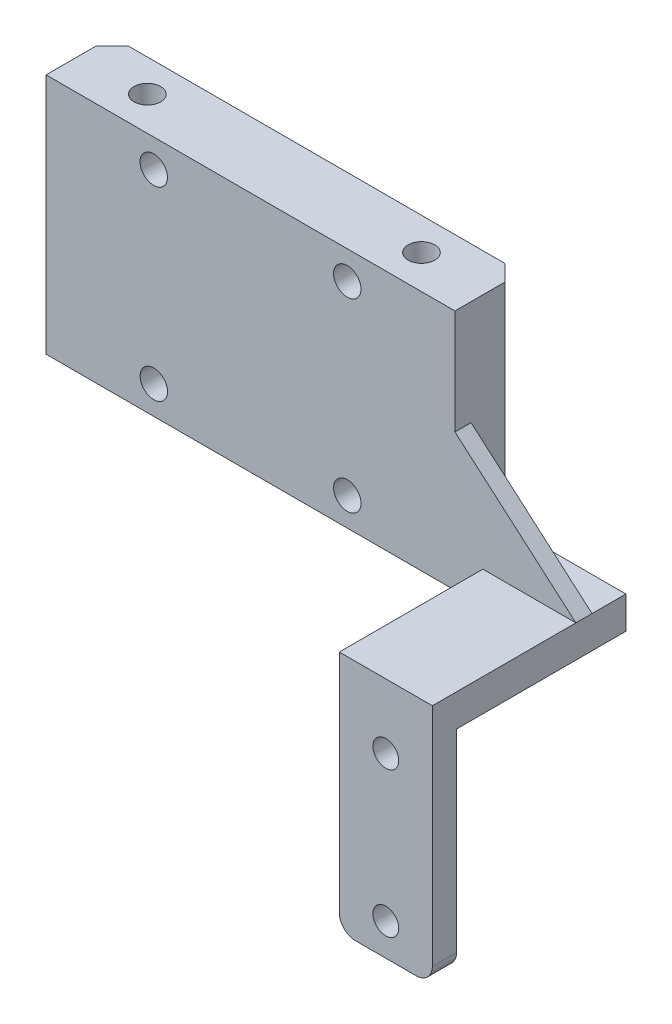
ISO-10303-21;
HEADER;
FILE_DESCRIPTION(('STEP AP214'),'2;1');
FILE_NAME('part.step','',(''),(''),'','','');
FILE_SCHEMA(('AUTOMOTIVE_DESIGN { 1 0 10303 214 1 1 1 1 }'));
ENDSEC;
DATA;
#1=APPLICATION_CONTEXT('core data for automotive mechanical design processes');
#2=APPLICATION_PROTOCOL_DEFINITION('international standard','automotive_design',2000,#1);
#3=PRODUCT_CONTEXT('',#1,'mechanical');
#4=PRODUCT('Part','Part','',(#3));
#5=PRODUCT_RELATED_PRODUCT_CATEGORY('part','',(#4));
#6=PRODUCT_DEFINITION_FORMATION('','',#4);
#7=PRODUCT_DEFINITION_CONTEXT('part definition',#1,'design');
#8=PRODUCT_DEFINITION('design','',#6,#7);
#9=PRODUCT_DEFINITION_SHAPE('','',#8);
#10=(LENGTH_UNIT() NAMED_UNIT(*) SI_UNIT(.MILLI.,.METRE.));
#11=(NAMED_UNIT(*) PLANE_ANGLE_UNIT() SI_UNIT($,.RADIAN.));
#12=(NAMED_UNIT(*) SI_UNIT($,.STERADIAN.) SOLID_ANGLE_UNIT());
#13=UNCERTAINTY_MEASURE_WITH_UNIT(LENGTH_MEASURE(1.E-05),#10,'distance_accuracy_value','');
#14=(GEOMETRIC_REPRESENTATION_CONTEXT(3) GLOBAL_UNCERTAINTY_ASSIGNED_CONTEXT((#13)) GLOBAL_UNIT_ASSIGNED_CONTEXT((#10,
#11,#12)) REPRESENTATION_CONTEXT('',''));
#15=CARTESIAN_POINT('',(0.,0.,0.));
#16=DIRECTION('',(0.,0.,1.));
#17=DIRECTION('',(1.,0.,0.));
#18=AXIS2_PLACEMENT_3D('',#15,#16,#17);
#19=CARTESIAN_POINT('',(26.8547945205479,10.7071917808219,8.2));
#20=DIRECTION('',(-1.,0.,0.));
#21=DIRECTION('',(0.,-1.,0.));
#22=AXIS2_PLACEMENT_3D('',#19,#20,#21);
#23=PLANE('',#22);
#24=DIRECTION('',(0.,0.,1.));
#25=VECTOR('',#24,1.);
#26=CARTESIAN_POINT('',(26.854794520548,-2.29280821917808,6.2));
#27=LINE('',#26,#25);
#28=CARTESIAN_POINT('',(26.854794520548,-2.29280821917808,6.2));
#29=VERTEX_POINT('',#28);
#30=CARTESIAN_POINT('',(26.854794520548,-2.29280821917808,8.2));
#31=VERTEX_POINT('',#30);
#32=EDGE_CURVE('E56',#29,#31,#27,.T.);
#33=ORIENTED_EDGE('',*,*,#32,.F.);
#34=DIRECTION('',(0.,1.,0.));
#35=VECTOR('',#34,1.);
#36=CARTESIAN_POINT('',(26.854794520548,0.,6.2));
#37=LINE('',#36,#35);
#38=CARTESIAN_POINT('',(26.854794520548,-15.2928082191781,6.2));
#39=VERTEX_POINT('',#38);
#40=EDGE_CURVE('E429',#39,#29,#37,.T.);
#41=ORIENTED_EDGE('',*,*,#40,.F.);
#42=DIRECTION('',(0.,0.,1.));
#43=VECTOR('',#42,1.);
#44=CARTESIAN_POINT('',(26.854794520548,-15.2928082191781,2.));
#45=LINE('',#44,#43);
#46=CARTESIAN_POINT('',(26.854794520548,-15.2928082191781,2.));
#47=VERTEX_POINT('',#46);
#48=EDGE_CURVE('E177',#47,#39,#45,.T.);
#49=ORIENTED_EDGE('',*,*,#48,.F.);
#50=DIRECTION('',(0.,1.,0.));
#51=VECTOR('',#50,1.);
#52=CARTESIAN_POINT('',(26.854794520548,-19.2928082191781,2.));
#53=LINE('',#52,#51);
#54=CARTESIAN_POINT('',(26.854794520548,10.7071917808219,2.));
#55=VERTEX_POINT('',#54);
#56=EDGE_CURVE('E330',#47,#55,#53,.T.);
#57=ORIENTED_EDGE('',*,*,#56,.T.);
#58=DIRECTION('',(0.,0.,-1.));
#59=VECTOR('',#58,1.);
#60=CARTESIAN_POINT('',(26.8547945205479,10.7071917808219,8.2));
#61=LINE('',#60,#59);
#62=CARTESIAN_POINT('',(26.8547945205479,10.7071917808219,8.2));
#63=VERTEX_POINT('',#62);
#64=EDGE_CURVE('E348',#63,#55,#61,.T.);
#65=ORIENTED_EDGE('',*,*,#64,.F.);
#66=DIRECTION('',(0.,1.,0.));
#67=VECTOR('',#66,1.);
#68=CARTESIAN_POINT('',(26.8547945205479,10.7071917808219,8.2));
#69=LINE('',#68,#67);
#70=EDGE_CURVE('E61',#31,#63,#69,.T.);
#71=ORIENTED_EDGE('',*,*,#70,.F.);
#72=EDGE_LOOP('',(#33,#41,#49,#57,#65,#71));
#73=FACE_BOUND('',#72,.T.);
#74=ADVANCED_FACE('F41',(#73),#23,.F.);
#75=CARTESIAN_POINT('',(0.,-15.2928082191781,0.));
#76=DIRECTION('',(0.,1.,0.));
#77=DIRECTION('',(0.,0.,1.));
#78=AXIS2_PLACEMENT_3D('',#75,#76,#77);
#79=PLANE('',#78);
#80=ORIENTED_EDGE('',*,*,#48,.T.);
#81=DIRECTION('',(-1.,0.,0.));
#82=VECTOR('',#81,1.);
#83=CARTESIAN_POINT('',(0.,-15.2928082191781,6.2));
#84=LINE('',#83,#82);
#85=CARTESIAN_POINT('',(41.8542610712507,-15.2928082191781,6.2));
#86=VERTEX_POINT('',#85);
#87=EDGE_CURVE('E172',#86,#39,#84,.T.);
#88=ORIENTED_EDGE('',*,*,#87,.F.);
#89=DIRECTION('',(0.,0.,1.));
#90=VECTOR('',#89,1.);
#91=CARTESIAN_POINT('',(41.8542610712507,-15.2928082191781,6.2));
#92=LINE('',#91,#90);
#93=CARTESIAN_POINT('',(41.8542610712507,-15.2928082191781,8.2));
#94=VERTEX_POINT('',#93);
#95=EDGE_CURVE('E165',#86,#94,#92,.T.);
#96=ORIENTED_EDGE('',*,*,#95,.T.);
#97=DIRECTION('',(-1.,0.,0.));
#98=VECTOR('',#97,1.);
#99=CARTESIAN_POINT('',(0.,-15.2928082191781,8.2));
#100=LINE('',#99,#98);
#101=CARTESIAN_POINT('',(30.314794520548,-15.2928082191781,8.2));
#102=VERTEX_POINT('',#101);
#103=EDGE_CURVE('E169',#94,#102,#100,.T.);
#104=ORIENTED_EDGE('',*,*,#103,.T.);
#105=DIRECTION('',(0.,0.,1.));
#106=VECTOR('',#105,1.);
#107=CARTESIAN_POINT('',(30.314794520548,-15.2928082191781,8.2));
#108=LINE('',#107,#106);
#109=CARTESIAN_POINT('',(30.314794520548,-15.2928082191781,26.));
#110=VERTEX_POINT('',#109);
#111=EDGE_CURVE('E196',#102,#110,#108,.T.);
#112=ORIENTED_EDGE('',*,*,#111,.T.);
#113=DIRECTION('',(1.,0.,0.));
#114=VECTOR('',#113,1.);
#115=CARTESIAN_POINT('',(30.314794520548,-15.2928082191781,26.));
#116=LINE('',#115,#114);
#117=CARTESIAN_POINT('',(41.854794520548,-15.2928082191781,26.));
#118=VERTEX_POINT('',#117);
#119=EDGE_CURVE('E198',#110,#118,#116,.T.);
#120=ORIENTED_EDGE('',*,*,#119,.T.);
#121=DIRECTION('',(0.,0.,-1.));
#122=VECTOR('',#121,1.);
#123=CARTESIAN_POINT('',(41.854794520548,-15.2928082191781,26.));
#124=LINE('',#123,#122);
#125=CARTESIAN_POINT('',(41.854794520548,-15.2928082191781,2.));
#126=VERTEX_POINT('',#125);
#127=EDGE_CURVE('E200',#118,#126,#124,.T.);
#128=ORIENTED_EDGE('',*,*,#127,.T.);
#129=DIRECTION('',(-1.,0.,0.));
#130=VECTOR('',#129,1.);
#131=CARTESIAN_POINT('',(41.854794520548,-15.2928082191781,2.));
#132=LINE('',#131,#130);
#133=EDGE_CURVE('E202',#126,#47,#132,.T.);
#134=ORIENTED_EDGE('',*,*,#133,.T.);
#135=EDGE_LOOP('',(#80,#88,#96,#104,#112,#120,#128,#134));
#136=FACE_BOUND('',#135,.T.);
#137=ADVANCED_FACE('F168',(#136),#79,.T.);
#138=CARTESIAN_POINT('',(41.854794520548,0.,2.));
#139=DIRECTION('',(0.,0.,1.));
#140=DIRECTION('',(1.,0.,0.));
#141=AXIS2_PLACEMENT_3D('',#138,#139,#140);
#142=PLANE('',#141);
#143=ORIENTED_EDGE('',*,*,#133,.F.);
#144=DIRECTION('',(0.,1.,0.));
#145=VECTOR('',#144,1.);
#146=CARTESIAN_POINT('',(41.854794520548,0.,2.));
#147=LINE('',#146,#145);
#148=CARTESIAN_POINT('',(41.854794520548,-19.2928082191781,2.));
#149=VERTEX_POINT('',#148);
#150=EDGE_CURVE('E256',#149,#126,#147,.T.);
#151=ORIENTED_EDGE('',*,*,#150,.F.);
#152=DIRECTION('',(-1.,0.,0.));
#153=VECTOR('',#152,1.);
#154=CARTESIAN_POINT('',(41.854794520548,-19.2928082191781,2.));
#155=LINE('',#154,#153);
#156=CARTESIAN_POINT('',(26.854794520548,-19.2928082191781,2.));
#157=VERTEX_POINT('',#156);
#158=EDGE_CURVE('E259',#149,#157,#155,.T.);
#159=ORIENTED_EDGE('',*,*,#158,.T.);
#160=EDGE_CURVE('E316',#157,#47,#53,.T.);
#161=ORIENTED_EDGE('',*,*,#160,.T.);
#162=EDGE_LOOP('',(#143,#151,#159,#161));
#163=FACE_BOUND('',#162,.T.);
#164=ADVANCED_FACE('F413',(#163),#142,.F.);
#165=CARTESIAN_POINT('',(41.854794520548,0.,0.));
#166=DIRECTION('',(1.,0.,0.));
#167=DIRECTION('',(0.,1.,0.));
#168=AXIS2_PLACEMENT_3D('',#165,#166,#167);
#169=PLANE('',#168);
#170=ORIENTED_EDGE('',*,*,#150,.T.);
#171=ORIENTED_EDGE('',*,*,#127,.F.);
#172=DIRECTION('',(0.,1.,0.));
#173=VECTOR('',#172,1.);
#174=CARTESIAN_POINT('',(41.854794520548,-19.2928082191781,26.));
#175=LINE('',#174,#173);
#176=CARTESIAN_POINT('',(41.854794520548,-43.2928082191781,26.));
#177=VERTEX_POINT('',#176);
#178=EDGE_CURVE('E250',#177,#118,#175,.T.);
#179=ORIENTED_EDGE('',*,*,#178,.F.);
#180=DIRECTION('',(0.,0.,1.));
#181=VECTOR('',#180,1.);
#182=CARTESIAN_POINT('',(41.854794520548,-43.2928082191781,0.));
#183=LINE('',#182,#181);
#184=CARTESIAN_POINT('',(41.854794520548,-43.2928082191781,23.));
#185=VERTEX_POINT('',#184);
#186=EDGE_CURVE('E11',#177,#185,#183,.F.);
#187=ORIENTED_EDGE('',*,*,#186,.T.);
#188=DIRECTION('',(0.,1.,0.));
#189=VECTOR('',#188,1.);
#190=CARTESIAN_POINT('',(41.854794520548,-45.2928082191781,23.));
#191=LINE('',#190,#189);
#192=CARTESIAN_POINT('',(41.854794520548,-19.2928082191781,23.));
#193=VERTEX_POINT('',#192);
#194=EDGE_CURVE('E242',#185,#193,#191,.T.);
#195=ORIENTED_EDGE('',*,*,#194,.T.);
#196=DIRECTION('',(0.,0.,-1.));
#197=VECTOR('',#196,1.);
#198=CARTESIAN_POINT('',(41.854794520548,-19.2928082191781,0.));
#199=LINE('',#198,#197);
#200=EDGE_CURVE('E253',#193,#149,#199,.T.);
#201=ORIENTED_EDGE('',*,*,#200,.T.);
#202=EDGE_LOOP('',(#170,#171,#179,#187,#195,#201));
#203=FACE_BOUND('',#202,.T.);
#204=ADVANCED_FACE('F409',(#203),#169,.T.);
#205=CARTESIAN_POINT('',(30.314794520548,-14.2928082191781,26.));
#206=DIRECTION('',(1.,0.,0.));
#207=DIRECTION('',(0.,0.,-1.));
#208=AXIS2_PLACEMENT_3D('',#205,#206,#207);
#209=PLANE('',#208);
#210=ORIENTED_EDGE('',*,*,#111,.F.);
#211=DIRECTION('',(0.,-1.,0.));
#212=VECTOR('',#211,1.);
#213=CARTESIAN_POINT('',(30.314794520548,-14.2928082191781,8.2));
#214=LINE('',#213,#212);
#215=CARTESIAN_POINT('',(30.314794520548,-19.2928082191781,8.2));
#216=VERTEX_POINT('',#215);
#217=EDGE_CURVE('E186',#102,#216,#214,.T.);
#218=ORIENTED_EDGE('',*,*,#217,.T.);
#219=DIRECTION('',(0.,0.,-1.));
#220=VECTOR('',#219,1.);
#221=CARTESIAN_POINT('',(30.314794520548,-19.2928082191781,4.64786949248719));
#222=LINE('',#221,#220);
#223=CARTESIAN_POINT('',(30.3147945205479,-19.2928082191781,4.64786949248719));
#224=VERTEX_POINT('',#223);
#225=EDGE_CURVE('E205',#216,#224,#222,.T.);
#226=ORIENTED_EDGE('',*,*,#225,.T.);
#227=DIRECTION('',(0.,-0.291399170931846,0.956601548807147));
#228=VECTOR('',#227,1.);
#229=CARTESIAN_POINT('',(30.314794520548,-24.8832190034705,23.));
#230=LINE('',#229,#228);
#231=CARTESIAN_POINT('',(30.314794520548,-24.8832190034705,23.));
#232=VERTEX_POINT('',#231);
#233=EDGE_CURVE('E209',#224,#232,#230,.T.);
#234=ORIENTED_EDGE('',*,*,#233,.T.);
#235=DIRECTION('',(0.,1.,0.));
#236=VECTOR('',#235,1.);
#237=CARTESIAN_POINT('',(30.314794520548,-45.2928082191781,23.));
#238=LINE('',#237,#236);
#239=CARTESIAN_POINT('',(30.314794520548,-43.2928082191781,23.));
#240=VERTEX_POINT('',#239);
#241=EDGE_CURVE('E246',#240,#232,#238,.T.);
#242=ORIENTED_EDGE('',*,*,#241,.F.);
#243=DIRECTION('',(0.,0.,-1.));
#244=VECTOR('',#243,1.);
#245=CARTESIAN_POINT('',(30.314794520548,-43.2928082191781,26.));
#246=LINE('',#245,#244);
#247=CARTESIAN_POINT('',(30.314794520548,-43.2928082191781,26.));
#248=VERTEX_POINT('',#247);
#249=EDGE_CURVE('E364',#240,#248,#246,.F.);
#250=ORIENTED_EDGE('',*,*,#249,.T.);
#251=DIRECTION('',(0.,-1.,0.));
#252=VECTOR('',#251,1.);
#253=CARTESIAN_POINT('',(30.314794520548,-14.2928082191781,26.));
#254=LINE('',#253,#252);
#255=EDGE_CURVE('E248',#110,#248,#254,.T.);
#256=ORIENTED_EDGE('',*,*,#255,.F.);
#257=EDGE_LOOP('',(#210,#218,#226,#234,#242,#250,#256));
#258=FACE_BOUND('',#257,.T.);
#259=ADVANCED_FACE('F386',(#258),#209,.F.);
#260=CARTESIAN_POINT('',(0.,0.,26.));
#261=DIRECTION('',(0.,0.,1.));
#262=DIRECTION('',(1.,0.,0.));
#263=AXIS2_PLACEMENT_3D('',#260,#261,#262);
#264=PLANE('',#263);
#265=CARTESIAN_POINT('',(36.084794520548,-41.2928082191781,26.));
#266=DIRECTION('',(0.,0.,-1.));
#267=DIRECTION('',(-1.,0.,0.));
#268=AXIS2_PLACEMENT_3D('',#265,#266,#267);
#269=CIRCLE('',#268,1.6);
#270=CARTESIAN_POINT('',(34.484794520548,-41.2928082191781,26.));
#271=VERTEX_POINT('',#270);
#272=EDGE_CURVE('E224',#271,#271,#269,.T.);
#273=ORIENTED_EDGE('',*,*,#272,.T.);
#274=EDGE_LOOP('',(#273));
#275=FACE_BOUND('',#274,.T.);
#276=CARTESIAN_POINT('',(36.084794520548,-23.2928082191781,26.));
#277=DIRECTION('',(0.,0.,-1.));
#278=DIRECTION('',(-1.,0.,0.));
#279=AXIS2_PLACEMENT_3D('',#276,#277,#278);
#280=CIRCLE('',#279,1.6);
#281=CARTESIAN_POINT('',(34.484794520548,-23.2928082191781,26.));
#282=VERTEX_POINT('',#281);
#283=EDGE_CURVE('E231',#282,#282,#280,.T.);
#284=ORIENTED_EDGE('',*,*,#283,.T.);
#285=EDGE_LOOP('',(#284));
#286=FACE_BOUND('',#285,.T.);
#287=ORIENTED_EDGE('',*,*,#178,.T.);
#288=ORIENTED_EDGE('',*,*,#119,.F.);
#289=ORIENTED_EDGE('',*,*,#255,.T.);
#290=CARTESIAN_POINT('',(32.314794520548,-43.2928082191781,26.));
#291=DIRECTION('',(0.,0.,1.));
#292=DIRECTION('',(1.,0.,0.));
#293=AXIS2_PLACEMENT_3D('',#290,#291,#292);
#294=CIRCLE('',#293,2.);
#295=CARTESIAN_POINT('',(32.314794520548,-45.2928082191781,26.));
#296=VERTEX_POINT('',#295);
#297=EDGE_CURVE('E49',#248,#296,#294,.T.);
#298=ORIENTED_EDGE('',*,*,#297,.T.);
#299=DIRECTION('',(-1.,0.,0.));
#300=VECTOR('',#299,1.);
#301=CARTESIAN_POINT('',(0.,-45.2928082191781,26.));
#302=LINE('',#301,#300);
#303=CARTESIAN_POINT('',(39.854794520548,-45.2928082191781,26.));
#304=VERTEX_POINT('',#303);
#305=EDGE_CURVE('E239',#304,#296,#302,.T.);
#306=ORIENTED_EDGE('',*,*,#305,.F.);
#307=CARTESIAN_POINT('',(39.854794520548,-43.2928082191781,26.));
#308=DIRECTION('',(0.,0.,1.));
#309=DIRECTION('',(1.,0.,0.));
#310=AXIS2_PLACEMENT_3D('',#307,#308,#309);
#311=CIRCLE('',#310,2.);
#312=EDGE_CURVE('E367',#304,#177,#311,.T.);
#313=ORIENTED_EDGE('',*,*,#312,.T.);
#314=EDGE_LOOP('',(#287,#288,#289,#298,#306,#313));
#315=FACE_BOUND('',#314,.T.);
#316=ADVANCED_FACE('F371',(#275,#286,#315),#264,.T.);
#317=CARTESIAN_POINT('',(-23.8452054794521,-19.2928082191781,8.2));
#318=DIRECTION('',(0.,1.,0.));
#319=DIRECTION('',(0.,0.,1.));
#320=AXIS2_PLACEMENT_3D('',#317,#318,#319);
#321=PLANE('',#320);
#322=CARTESIAN_POINT('',(-15.495205479452,-19.2928082191781,4.));
#323=DIRECTION('',(0.,-1.,0.));
#324=DIRECTION('',(0.,0.,-1.));
#325=AXIS2_PLACEMENT_3D('',#322,#323,#324);
#326=CIRCLE('',#325,1.65);
#327=CARTESIAN_POINT('',(-15.495205479452,-19.2928082191781,2.35));
#328=VERTEX_POINT('',#327);
#329=EDGE_CURVE('E266',#328,#328,#326,.T.);
#330=ORIENTED_EDGE('',*,*,#329,.F.);
#331=EDGE_LOOP('',(#330));
#332=FACE_BOUND('',#331,.T.);
#333=CARTESIAN_POINT('',(18.504794520548,-19.2928082191781,4.00000000000001));
#334=DIRECTION('',(0.,-1.,0.));
#335=DIRECTION('',(0.,0.,-1.));
#336=AXIS2_PLACEMENT_3D('',#333,#334,#335);
#337=CIRCLE('',#336,1.65);
#338=CARTESIAN_POINT('',(18.504794520548,-19.2928082191781,2.35000000000001));
#339=VERTEX_POINT('',#338);
#340=EDGE_CURVE('E261',#339,#339,#337,.T.);
#341=ORIENTED_EDGE('',*,*,#340,.F.);
#342=EDGE_LOOP('',(#341));
#343=FACE_BOUND('',#342,.T.);
#344=DIRECTION('',(0.,0.,-1.));
#345=VECTOR('',#344,1.);
#346=CARTESIAN_POINT('',(31.314794520548,-19.2928082191781,4.64786949248719));
#347=LINE('',#346,#345);
#348=CARTESIAN_POINT('',(31.314794520548,-19.2928082191781,23.));
#349=VERTEX_POINT('',#348);
#350=CARTESIAN_POINT('',(31.3147945205479,-19.2928082191781,4.6478694924872));
#351=VERTEX_POINT('',#350);
#352=EDGE_CURVE('E208',#349,#351,#347,.T.);
#353=ORIENTED_EDGE('',*,*,#352,.T.);
#354=DIRECTION('',(-1.,0.,0.));
#355=VECTOR('',#354,1.);
#356=CARTESIAN_POINT('',(31.314794520548,-19.2928082191781,4.64786949248719));
#357=LINE('',#356,#355);
#358=EDGE_CURVE('E214',#351,#224,#357,.T.);
#359=ORIENTED_EDGE('',*,*,#358,.T.);
#360=ORIENTED_EDGE('',*,*,#225,.F.);
#361=DIRECTION('',(1.,0.,0.));
#362=VECTOR('',#361,1.);
#363=CARTESIAN_POINT('',(-23.8452054794521,-19.2928082191781,8.2));
#364=LINE('',#363,#362);
#365=CARTESIAN_POINT('',(-23.8452054794521,-19.2928082191781,8.2));
#366=VERTEX_POINT('',#365);
#367=EDGE_CURVE('E335',#366,#216,#364,.T.);
#368=ORIENTED_EDGE('',*,*,#367,.F.);
#369=DIRECTION('',(0.,0.,-1.));
#370=VECTOR('',#369,1.);
#371=CARTESIAN_POINT('',(-23.8452054794521,-19.2928082191781,8.2));
#372=LINE('',#371,#370);
#373=CARTESIAN_POINT('',(-23.8452054794521,-19.2928082191781,2.));
#374=VERTEX_POINT('',#373);
#375=EDGE_CURVE('E351',#366,#374,#372,.T.);
#376=ORIENTED_EDGE('',*,*,#375,.T.);
#377=DIRECTION('',(0.707106781186548,0.,-0.707106781186547));
#378=VECTOR('',#377,1.);
#379=CARTESIAN_POINT('',(-21.8452054794521,-19.2928082191781,0.));
#380=LINE('',#379,#378);
#381=CARTESIAN_POINT('',(-21.8452054794521,-19.2928082191781,0.));
#382=VERTEX_POINT('',#381);
#383=EDGE_CURVE('E310',#374,#382,#380,.T.);
#384=ORIENTED_EDGE('',*,*,#383,.T.);
#385=DIRECTION('',(1.,0.,0.));
#386=VECTOR('',#385,1.);
#387=CARTESIAN_POINT('',(-23.8452054794521,-19.2928082191781,0.));
#388=LINE('',#387,#386);
#389=CARTESIAN_POINT('',(24.8547945205479,-19.2928082191781,0.));
#390=VERTEX_POINT('',#389);
#391=EDGE_CURVE('E320',#382,#390,#388,.T.);
#392=ORIENTED_EDGE('',*,*,#391,.T.);
#393=DIRECTION('',(0.707106781186555,0.,0.70710678118654));
#394=VECTOR('',#393,1.);
#395=CARTESIAN_POINT('',(24.8547945205479,-19.2928082191781,0.));
#396=LINE('',#395,#394);
#397=EDGE_CURVE('E322',#390,#157,#396,.T.);
#398=ORIENTED_EDGE('',*,*,#397,.T.);
#399=ORIENTED_EDGE('',*,*,#158,.F.);
#400=ORIENTED_EDGE('',*,*,#200,.F.);
#401=DIRECTION('',(1.,0.,0.));
#402=VECTOR('',#401,1.);
#403=CARTESIAN_POINT('',(0.,-19.2928082191781,23.));
#404=LINE('',#403,#402);
#405=EDGE_CURVE('E227',#349,#193,#404,.T.);
#406=ORIENTED_EDGE('',*,*,#405,.F.);
#407=EDGE_LOOP('',(#353,#359,#360,#368,#376,#384,#392,#398,#399,#400,#406));
#408=FACE_BOUND('',#407,.T.);
#409=ADVANCED_FACE('F399',(#332,#343,#408),#321,.F.);
#410=CARTESIAN_POINT('',(-23.8452054794521,10.7071917808219,8.2));
#411=DIRECTION('',(1.,0.,0.));
#412=DIRECTION('',(0.,1.,0.));
#413=AXIS2_PLACEMENT_3D('',#410,#411,#412);
#414=PLANE('',#413);
#415=DIRECTION('',(0.,0.,-1.));
#416=VECTOR('',#415,1.);
#417=CARTESIAN_POINT('',(-23.8452054794521,10.7071917808219,8.2));
#418=LINE('',#417,#416);
#419=CARTESIAN_POINT('',(-23.8452054794521,10.7071917808219,8.2));
#420=VERTEX_POINT('',#419);
#421=CARTESIAN_POINT('',(-23.8452054794521,10.7071917808219,2.));
#422=VERTEX_POINT('',#421);
#423=EDGE_CURVE('E341',#420,#422,#418,.T.);
#424=ORIENTED_EDGE('',*,*,#423,.T.);
#425=DIRECTION('',(0.,1.,0.));
#426=VECTOR('',#425,1.);
#427=CARTESIAN_POINT('',(-23.8452054794521,-19.2928082191781,2.));
#428=LINE('',#427,#426);
#429=EDGE_CURVE('E313',#374,#422,#428,.T.);
#430=ORIENTED_EDGE('',*,*,#429,.F.);
#431=ORIENTED_EDGE('',*,*,#375,.F.);
#432=DIRECTION('',(0.,-1.,0.));
#433=VECTOR('',#432,1.);
#434=CARTESIAN_POINT('',(-23.8452054794521,10.7071917808219,8.2));
#435=LINE('',#434,#433);
#436=EDGE_CURVE('E332',#420,#366,#435,.T.);
#437=ORIENTED_EDGE('',*,*,#436,.F.);
#438=EDGE_LOOP('',(#424,#430,#431,#437));
#439=FACE_BOUND('',#438,.T.);
#440=ADVANCED_FACE('F451',(#439),#414,.F.);
#441=CARTESIAN_POINT('',(-23.8452054794521,10.7071917808219,8.2));
#442=DIRECTION('',(0.,-1.,0.));
#443=DIRECTION('',(0.,0.,-1.));
#444=AXIS2_PLACEMENT_3D('',#441,#442,#443);
#445=PLANE('',#444);
#446=CARTESIAN_POINT('',(-15.495205479452,10.7071917808219,4.));
#447=DIRECTION('',(0.,-1.,0.));
#448=DIRECTION('',(0.,0.,-1.));
#449=AXIS2_PLACEMENT_3D('',#446,#447,#448);
#450=CIRCLE('',#449,1.65);
#451=CARTESIAN_POINT('',(-15.495205479452,10.7071917808219,2.35));
#452=VERTEX_POINT('',#451);
#453=EDGE_CURVE('E262',#452,#452,#450,.T.);
#454=ORIENTED_EDGE('',*,*,#453,.T.);
#455=EDGE_LOOP('',(#454));
#456=FACE_BOUND('',#455,.T.);
#457=CARTESIAN_POINT('',(18.504794520548,10.7071917808219,4.00000000000001));
#458=DIRECTION('',(0.,-1.,0.));
#459=DIRECTION('',(0.,0.,-1.));
#460=AXIS2_PLACEMENT_3D('',#457,#458,#459);
#461=CIRCLE('',#460,1.65);
#462=CARTESIAN_POINT('',(18.504794520548,10.7071917808219,2.35000000000001));
#463=VERTEX_POINT('',#462);
#464=EDGE_CURVE('E269',#463,#463,#461,.T.);
#465=ORIENTED_EDGE('',*,*,#464,.T.);
#466=EDGE_LOOP('',(#465));
#467=FACE_BOUND('',#466,.T.);
#468=DIRECTION('',(-1.,0.,0.));
#469=VECTOR('',#468,1.);
#470=CARTESIAN_POINT('',(-23.8452054794521,10.7071917808219,0.));
#471=LINE('',#470,#469);
#472=CARTESIAN_POINT('',(24.8547945205479,10.7071917808219,0.));
#473=VERTEX_POINT('',#472);
#474=CARTESIAN_POINT('',(-21.8452054794521,10.7071917808219,0.));
#475=VERTEX_POINT('',#474);
#476=EDGE_CURVE('E336',#473,#475,#471,.T.);
#477=ORIENTED_EDGE('',*,*,#476,.T.);
#478=DIRECTION('',(0.707106781186548,0.,-0.707106781186547));
#479=VECTOR('',#478,1.);
#480=CARTESIAN_POINT('',(-21.8452054794521,10.7071917808219,0.));
#481=LINE('',#480,#479);
#482=EDGE_CURVE('E314',#422,#475,#481,.T.);
#483=ORIENTED_EDGE('',*,*,#482,.F.);
#484=ORIENTED_EDGE('',*,*,#423,.F.);
#485=DIRECTION('',(-1.,0.,0.));
#486=VECTOR('',#485,1.);
#487=CARTESIAN_POINT('',(-23.8452054794521,10.7071917808219,8.2));
#488=LINE('',#487,#486);
#489=EDGE_CURVE('E339',#63,#420,#488,.T.);
#490=ORIENTED_EDGE('',*,*,#489,.F.);
#491=ORIENTED_EDGE('',*,*,#64,.T.);
#492=DIRECTION('',(0.707106781186555,0.,0.70710678118654));
#493=VECTOR('',#492,1.);
#494=CARTESIAN_POINT('',(24.8547945205479,10.7071917808219,0.));
#495=LINE('',#494,#493);
#496=EDGE_CURVE('E309',#473,#55,#495,.T.);
#497=ORIENTED_EDGE('',*,*,#496,.F.);
#498=EDGE_LOOP('',(#477,#483,#484,#490,#491,#497));
#499=FACE_BOUND('',#498,.T.);
#500=ADVANCED_FACE('F425',(#456,#467,#499),#445,.F.);
#501=CARTESIAN_POINT('',(0.,0.,8.2));
#502=DIRECTION('',(0.,0.,1.));
#503=DIRECTION('',(1.,0.,0.));
#504=AXIS2_PLACEMENT_3D('',#501,#502,#503);
#505=PLANE('',#504);
#506=DIRECTION('',(0.755677554928334,-0.654943839559954,0.));
#507=VECTOR('',#506,1.);
#508=CARTESIAN_POINT('',(10.384631367429,11.9818408336254,8.2));
#509=LINE('',#508,#507);
#510=EDGE_CURVE('E184',#31,#94,#509,.T.);
#511=ORIENTED_EDGE('',*,*,#510,.F.);
#512=ORIENTED_EDGE('',*,*,#70,.T.);
#513=ORIENTED_EDGE('',*,*,#489,.T.);
#514=ORIENTED_EDGE('',*,*,#436,.T.);
#515=ORIENTED_EDGE('',*,*,#367,.T.);
#516=ORIENTED_EDGE('',*,*,#217,.F.);
#517=ORIENTED_EDGE('',*,*,#103,.F.);
#518=EDGE_LOOP('',(#511,#512,#513,#514,#515,#516,#517));
#519=FACE_BOUND('',#518,.T.);
#520=CARTESIAN_POINT('',(-10.4860555065816,-15.7928082191781,8.2));
#521=DIRECTION('',(0.,0.,-1.));
#522=DIRECTION('',(-1.,0.,0.));
#523=AXIS2_PLACEMENT_3D('',#520,#521,#522);
#524=CIRCLE('',#523,1.7);
#525=CARTESIAN_POINT('',(-12.1860555065816,-15.7928082191781,8.2));
#526=VERTEX_POINT('',#525);
#527=EDGE_CURVE('E279',#526,#526,#524,.T.);
#528=ORIENTED_EDGE('',*,*,#527,.T.);
#529=EDGE_LOOP('',(#528));
#530=FACE_BOUND('',#529,.T.);
#531=CARTESIAN_POINT('',(13.5047945205479,-15.7928082191781,8.2));
#532=DIRECTION('',(0.,0.,-1.));
#533=DIRECTION('',(-1.,0.,0.));
#534=AXIS2_PLACEMENT_3D('',#531,#532,#533);
#535=CIRCLE('',#534,1.7);
#536=CARTESIAN_POINT('',(11.8047945205479,-15.7928082191781,8.2));
#537=VERTEX_POINT('',#536);
#538=EDGE_CURVE('E288',#537,#537,#535,.T.);
#539=ORIENTED_EDGE('',*,*,#538,.T.);
#540=EDGE_LOOP('',(#539));
#541=FACE_BOUND('',#540,.T.);
#542=CARTESIAN_POINT('',(13.5047945205479,7.20719178082191,8.2));
#543=DIRECTION('',(0.,0.,-1.));
#544=DIRECTION('',(-1.,0.,0.));
#545=AXIS2_PLACEMENT_3D('',#542,#543,#544);
#546=CIRCLE('',#545,1.7);
#547=CARTESIAN_POINT('',(11.8047945205479,7.20719178082191,8.2));
#548=VERTEX_POINT('',#547);
#549=EDGE_CURVE('E297',#548,#548,#546,.T.);
#550=ORIENTED_EDGE('',*,*,#549,.T.);
#551=EDGE_LOOP('',(#550));
#552=FACE_BOUND('',#551,.T.);
#553=CARTESIAN_POINT('',(-10.4952054794521,7.20719178082192,8.2));
#554=DIRECTION('',(0.,0.,-1.));
#555=DIRECTION('',(-1.,0.,0.));
#556=AXIS2_PLACEMENT_3D('',#553,#554,#555);
#557=CIRCLE('',#556,1.7);
#558=CARTESIAN_POINT('',(-12.1952054794521,7.20719178082192,8.2));
#559=VERTEX_POINT('',#558);
#560=EDGE_CURVE('E306',#559,#559,#557,.T.);
#561=ORIENTED_EDGE('',*,*,#560,.T.);
#562=EDGE_LOOP('',(#561));
#563=FACE_BOUND('',#562,.T.);
#564=ADVANCED_FACE('F182',(#519,#530,#541,#552,#563),#505,.T.);
#565=CARTESIAN_POINT('',(0.,0.,0.));
#566=DIRECTION('',(0.,0.,1.));
#567=DIRECTION('',(1.,0.,0.));
#568=AXIS2_PLACEMENT_3D('',#565,#566,#567);
#569=PLANE('',#568);
#570=CARTESIAN_POINT('',(-10.4860555065816,-15.7928082191781,0.));
#571=DIRECTION('',(0.,0.,-1.));
#572=DIRECTION('',(-1.,0.,0.));
#573=AXIS2_PLACEMENT_3D('',#570,#571,#572);
#574=CIRCLE('',#573,3.15);
#575=CARTESIAN_POINT('',(-13.6360555065816,-15.7928082191781,0.));
#576=VERTEX_POINT('',#575);
#577=EDGE_CURVE('E265',#576,#576,#574,.T.);
#578=ORIENTED_EDGE('',*,*,#577,.F.);
#579=EDGE_LOOP('',(#578));
#580=FACE_BOUND('',#579,.T.);
#581=CARTESIAN_POINT('',(13.5047945205479,-15.7928082191781,0.));
#582=DIRECTION('',(0.,0.,-1.));
#583=DIRECTION('',(-1.,0.,0.));
#584=AXIS2_PLACEMENT_3D('',#581,#582,#583);
#585=CIRCLE('',#584,3.15);
#586=CARTESIAN_POINT('',(10.3547945205479,-15.7928082191781,0.));
#587=VERTEX_POINT('',#586);
#588=EDGE_CURVE('E282',#587,#587,#585,.T.);
#589=ORIENTED_EDGE('',*,*,#588,.F.);
#590=EDGE_LOOP('',(#589));
#591=FACE_BOUND('',#590,.T.);
#592=CARTESIAN_POINT('',(13.5047945205479,7.20719178082191,0.));
#593=DIRECTION('',(0.,0.,-1.));
#594=DIRECTION('',(-1.,0.,0.));
#595=AXIS2_PLACEMENT_3D('',#592,#593,#594);
#596=CIRCLE('',#595,3.15);
#597=CARTESIAN_POINT('',(10.3547945205479,7.20719178082191,0.));
#598=VERTEX_POINT('',#597);
#599=EDGE_CURVE('E291',#598,#598,#596,.T.);
#600=ORIENTED_EDGE('',*,*,#599,.F.);
#601=EDGE_LOOP('',(#600));
#602=FACE_BOUND('',#601,.T.);
#603=CARTESIAN_POINT('',(-10.4952054794521,7.20719178082192,0.));
#604=DIRECTION('',(0.,0.,-1.));
#605=DIRECTION('',(-1.,0.,0.));
#606=AXIS2_PLACEMENT_3D('',#603,#604,#605);
#607=CIRCLE('',#606,3.15);
#608=CARTESIAN_POINT('',(-13.6452054794521,7.20719178082192,0.));
#609=VERTEX_POINT('',#608);
#610=EDGE_CURVE('E300',#609,#609,#607,.T.);
#611=ORIENTED_EDGE('',*,*,#610,.F.);
#612=EDGE_LOOP('',(#611));
#613=FACE_BOUND('',#612,.T.);
#614=ORIENTED_EDGE('',*,*,#391,.F.);
#615=DIRECTION('',(0.,1.,0.));
#616=VECTOR('',#615,1.);
#617=CARTESIAN_POINT('',(-21.8452054794521,-19.2928082191781,0.));
#618=LINE('',#617,#616);
#619=EDGE_CURVE('E317',#382,#475,#618,.T.);
#620=ORIENTED_EDGE('',*,*,#619,.T.);
#621=ORIENTED_EDGE('',*,*,#476,.F.);
#622=DIRECTION('',(0.,1.,0.));
#623=VECTOR('',#622,1.);
#624=CARTESIAN_POINT('',(24.8547945205479,-19.2928082191781,0.));
#625=LINE('',#624,#623);
#626=EDGE_CURVE('E325',#390,#473,#625,.T.);
#627=ORIENTED_EDGE('',*,*,#626,.F.);
#628=EDGE_LOOP('',(#614,#620,#621,#627));
#629=FACE_BOUND('',#628,.T.);
#630=ADVANCED_FACE('F421',(#580,#591,#602,#613,#629),#569,.F.);
#631=CARTESIAN_POINT('',(24.8547945205479,-19.2928082191781,0.));
#632=DIRECTION('',(-0.70710678118654,0.,0.707106781186555));
#633=DIRECTION('',(0.707106781186555,0.,0.70710678118654));
#634=AXIS2_PLACEMENT_3D('',#631,#632,#633);
#635=PLANE('',#634);
#636=ORIENTED_EDGE('',*,*,#496,.T.);
#637=ORIENTED_EDGE('',*,*,#56,.F.);
#638=ORIENTED_EDGE('',*,*,#160,.F.);
#639=ORIENTED_EDGE('',*,*,#397,.F.);
#640=ORIENTED_EDGE('',*,*,#626,.T.);
#641=EDGE_LOOP('',(#636,#637,#638,#639,#640));
#642=FACE_BOUND('',#641,.T.);
#643=ADVANCED_FACE('F416',(#642),#635,.F.);
#644=CARTESIAN_POINT('',(-21.8452054794521,-19.2928082191781,0.));
#645=DIRECTION('',(0.707106781186547,0.,0.707106781186548));
#646=DIRECTION('',(0.707106781186548,0.,-0.707106781186547));
#647=AXIS2_PLACEMENT_3D('',#644,#645,#646);
#648=PLANE('',#647);
#649=ORIENTED_EDGE('',*,*,#482,.T.);
#650=ORIENTED_EDGE('',*,*,#619,.F.);
#651=ORIENTED_EDGE('',*,*,#383,.F.);
#652=ORIENTED_EDGE('',*,*,#429,.T.);
#653=EDGE_LOOP('',(#649,#650,#651,#652));
#654=FACE_BOUND('',#653,.T.);
#655=ADVANCED_FACE('F527',(#654),#648,.F.);
#656=CARTESIAN_POINT('',(-10.4952054794521,7.20719178082192,0.));
#657=DIRECTION('',(0.,0.,-1.));
#658=DIRECTION('',(-1.,0.,0.));
#659=AXIS2_PLACEMENT_3D('',#656,#657,#658);
#660=CYLINDRICAL_SURFACE('',#659,1.7);
#661=ORIENTED_EDGE('',*,*,#560,.F.);
#662=EDGE_LOOP('',(#661));
#663=FACE_BOUND('',#662,.T.);
#664=CARTESIAN_POINT('',(-10.4952054794521,7.20719178082192,1.45));
#665=DIRECTION('',(0.,0.,-1.));
#666=DIRECTION('',(-1.,0.,0.));
#667=AXIS2_PLACEMENT_3D('',#664,#665,#666);
#668=CIRCLE('',#667,1.7);
#669=CARTESIAN_POINT('',(-12.1952054794521,7.20719178082192,1.45));
#670=VERTEX_POINT('',#669);
#671=EDGE_CURVE('E303',#670,#670,#668,.T.);
#672=ORIENTED_EDGE('',*,*,#671,.T.);
#673=EDGE_LOOP('',(#672));
#674=FACE_BOUND('',#673,.T.);
#675=ADVANCED_FACE('F523',(#663,#674),#660,.F.);
#676=CARTESIAN_POINT('',(-10.4952054794521,7.20719178082192,0.));
#677=DIRECTION('',(0.,0.,-1.));
#678=DIRECTION('',(-1.,0.,0.));
#679=AXIS2_PLACEMENT_3D('',#676,#677,#678);
#680=CONICAL_SURFACE('',#679,3.15,0.785398163397448);
#681=ORIENTED_EDGE('',*,*,#671,.F.);
#682=EDGE_LOOP('',(#681));
#683=FACE_BOUND('',#682,.T.);
#684=ORIENTED_EDGE('',*,*,#610,.T.);
#685=EDGE_LOOP('',(#684));
#686=FACE_BOUND('',#685,.T.);
#687=ADVANCED_FACE('F519',(#683,#686),#680,.F.);
#688=CARTESIAN_POINT('',(13.5047945205479,7.20719178082191,0.));
#689=DIRECTION('',(0.,0.,-1.));
#690=DIRECTION('',(-1.,0.,0.));
#691=AXIS2_PLACEMENT_3D('',#688,#689,#690);
#692=CYLINDRICAL_SURFACE('',#691,1.7);
#693=ORIENTED_EDGE('',*,*,#549,.F.);
#694=EDGE_LOOP('',(#693));
#695=FACE_BOUND('',#694,.T.);
#696=CARTESIAN_POINT('',(13.5047945205479,7.20719178082191,1.45));
#697=DIRECTION('',(0.,0.,-1.));
#698=DIRECTION('',(-1.,0.,0.));
#699=AXIS2_PLACEMENT_3D('',#696,#697,#698);
#700=CIRCLE('',#699,1.7);
#701=CARTESIAN_POINT('',(11.8047945205479,7.20719178082191,1.45));
#702=VERTEX_POINT('',#701);
#703=EDGE_CURVE('E294',#702,#702,#700,.T.);
#704=ORIENTED_EDGE('',*,*,#703,.T.);
#705=EDGE_LOOP('',(#704));
#706=FACE_BOUND('',#705,.T.);
#707=ADVANCED_FACE('F515',(#695,#706),#692,.F.);
#708=CARTESIAN_POINT('',(13.5047945205479,7.20719178082191,0.));
#709=DIRECTION('',(0.,0.,-1.));
#710=DIRECTION('',(-1.,0.,0.));
#711=AXIS2_PLACEMENT_3D('',#708,#709,#710);
#712=CONICAL_SURFACE('',#711,3.15,0.785398163397448);
#713=ORIENTED_EDGE('',*,*,#703,.F.);
#714=EDGE_LOOP('',(#713));
#715=FACE_BOUND('',#714,.T.);
#716=ORIENTED_EDGE('',*,*,#599,.T.);
#717=EDGE_LOOP('',(#716));
#718=FACE_BOUND('',#717,.T.);
#719=ADVANCED_FACE('F511',(#715,#718),#712,.F.);
#720=CARTESIAN_POINT('',(13.5047945205479,-15.7928082191781,0.));
#721=DIRECTION('',(0.,0.,-1.));
#722=DIRECTION('',(-1.,0.,0.));
#723=AXIS2_PLACEMENT_3D('',#720,#721,#722);
#724=CYLINDRICAL_SURFACE('',#723,1.7);
#725=ORIENTED_EDGE('',*,*,#538,.F.);
#726=EDGE_LOOP('',(#725));
#727=FACE_BOUND('',#726,.T.);
#728=CARTESIAN_POINT('',(13.5047945205479,-15.7928082191781,1.45));
#729=DIRECTION('',(0.,0.,-1.));
#730=DIRECTION('',(-1.,0.,0.));
#731=AXIS2_PLACEMENT_3D('',#728,#729,#730);
#732=CIRCLE('',#731,1.7);
#733=CARTESIAN_POINT('',(11.8047945205479,-15.7928082191781,1.45));
#734=VERTEX_POINT('',#733);
#735=EDGE_CURVE('E285',#734,#734,#732,.T.);
#736=ORIENTED_EDGE('',*,*,#735,.T.);
#737=EDGE_LOOP('',(#736));
#738=FACE_BOUND('',#737,.T.);
#739=ADVANCED_FACE('F507',(#727,#738),#724,.F.);
#740=CARTESIAN_POINT('',(13.5047945205479,-15.7928082191781,0.));
#741=DIRECTION('',(0.,0.,-1.));
#742=DIRECTION('',(-1.,0.,0.));
#743=AXIS2_PLACEMENT_3D('',#740,#741,#742);
#744=CONICAL_SURFACE('',#743,3.15,0.785398163397448);
#745=ORIENTED_EDGE('',*,*,#735,.F.);
#746=EDGE_LOOP('',(#745));
#747=FACE_BOUND('',#746,.T.);
#748=ORIENTED_EDGE('',*,*,#588,.T.);
#749=EDGE_LOOP('',(#748));
#750=FACE_BOUND('',#749,.T.);
#751=ADVANCED_FACE('F503',(#747,#750),#744,.F.);
#752=CARTESIAN_POINT('',(-10.4860555065816,-15.7928082191781,0.));
#753=DIRECTION('',(0.,0.,-1.));
#754=DIRECTION('',(-1.,0.,0.));
#755=AXIS2_PLACEMENT_3D('',#752,#753,#754);
#756=CYLINDRICAL_SURFACE('',#755,1.7);
#757=ORIENTED_EDGE('',*,*,#527,.F.);
#758=EDGE_LOOP('',(#757));
#759=FACE_BOUND('',#758,.T.);
#760=CARTESIAN_POINT('',(-10.4860555065816,-15.7928082191781,1.45));
#761=DIRECTION('',(0.,0.,-1.));
#762=DIRECTION('',(-1.,0.,0.));
#763=AXIS2_PLACEMENT_3D('',#760,#761,#762);
#764=CIRCLE('',#763,1.7);
#765=CARTESIAN_POINT('',(-12.1860555065816,-15.7928082191781,1.45));
#766=VERTEX_POINT('',#765);
#767=EDGE_CURVE('E276',#766,#766,#764,.T.);
#768=ORIENTED_EDGE('',*,*,#767,.T.);
#769=EDGE_LOOP('',(#768));
#770=FACE_BOUND('',#769,.T.);
#771=ADVANCED_FACE('F499',(#759,#770),#756,.F.);
#772=CARTESIAN_POINT('',(-10.4860555065816,-15.7928082191781,0.));
#773=DIRECTION('',(0.,0.,-1.));
#774=DIRECTION('',(-1.,0.,0.));
#775=AXIS2_PLACEMENT_3D('',#772,#773,#774);
#776=CONICAL_SURFACE('',#775,3.15,0.785398163397448);
#777=ORIENTED_EDGE('',*,*,#767,.F.);
#778=EDGE_LOOP('',(#777));
#779=FACE_BOUND('',#778,.T.);
#780=ORIENTED_EDGE('',*,*,#577,.T.);
#781=EDGE_LOOP('',(#780));
#782=FACE_BOUND('',#781,.T.);
#783=ADVANCED_FACE('F495',(#779,#782),#776,.F.);
#784=CARTESIAN_POINT('',(18.504794520548,10.7071917808219,4.00000000000001));
#785=DIRECTION('',(0.,-1.,0.));
#786=DIRECTION('',(0.,0.,-1.));
#787=AXIS2_PLACEMENT_3D('',#784,#785,#786);
#788=CYLINDRICAL_SURFACE('',#787,1.65);
#789=ORIENTED_EDGE('',*,*,#464,.F.);
#790=EDGE_LOOP('',(#789));
#791=FACE_BOUND('',#790,.T.);
#792=ORIENTED_EDGE('',*,*,#340,.T.);
#793=EDGE_LOOP('',(#792));
#794=FACE_BOUND('',#793,.T.);
#795=ADVANCED_FACE('F491',(#791,#794),#788,.F.);
#796=CARTESIAN_POINT('',(-15.495205479452,10.7071917808219,4.));
#797=DIRECTION('',(0.,-1.,0.));
#798=DIRECTION('',(0.,0.,-1.));
#799=AXIS2_PLACEMENT_3D('',#796,#797,#798);
#800=CYLINDRICAL_SURFACE('',#799,1.65);
#801=ORIENTED_EDGE('',*,*,#453,.F.);
#802=EDGE_LOOP('',(#801));
#803=FACE_BOUND('',#802,.T.);
#804=ORIENTED_EDGE('',*,*,#329,.T.);
#805=EDGE_LOOP('',(#804));
#806=FACE_BOUND('',#805,.T.);
#807=ADVANCED_FACE('F478',(#803,#806),#800,.F.);
#808=CARTESIAN_POINT('',(0.,-45.2928082191781,23.));
#809=DIRECTION('',(0.,0.,1.));
#810=DIRECTION('',(1.,0.,0.));
#811=AXIS2_PLACEMENT_3D('',#808,#809,#810);
#812=PLANE('',#811);
#813=CARTESIAN_POINT('',(36.084794520548,-41.2928082191781,23.));
#814=DIRECTION('',(0.,0.,-1.));
#815=DIRECTION('',(-1.,0.,0.));
#816=AXIS2_PLACEMENT_3D('',#813,#814,#815);
#817=CIRCLE('',#816,1.6);
#818=CARTESIAN_POINT('',(34.484794520548,-41.2928082191781,23.));
#819=VERTEX_POINT('',#818);
#820=EDGE_CURVE('E228',#819,#819,#817,.T.);
#821=ORIENTED_EDGE('',*,*,#820,.F.);
#822=EDGE_LOOP('',(#821));
#823=FACE_BOUND('',#822,.T.);
#824=CARTESIAN_POINT('',(36.084794520548,-23.2928082191781,23.));
#825=DIRECTION('',(0.,0.,-1.));
#826=DIRECTION('',(-1.,0.,0.));
#827=AXIS2_PLACEMENT_3D('',#824,#825,#826);
#828=CIRCLE('',#827,1.6);
#829=CARTESIAN_POINT('',(34.484794520548,-23.2928082191781,23.));
#830=VERTEX_POINT('',#829);
#831=EDGE_CURVE('E222',#830,#830,#828,.T.);
#832=ORIENTED_EDGE('',*,*,#831,.F.);
#833=EDGE_LOOP('',(#832));
#834=FACE_BOUND('',#833,.T.);
#835=DIRECTION('',(1.,0.,0.));
#836=VECTOR('',#835,1.);
#837=CARTESIAN_POINT('',(0.,-45.2928082191781,23.));
#838=LINE('',#837,#836);
#839=CARTESIAN_POINT('',(32.314794520548,-45.2928082191781,23.));
#840=VERTEX_POINT('',#839);
#841=CARTESIAN_POINT('',(39.854794520548,-45.2928082191781,23.));
#842=VERTEX_POINT('',#841);
#843=EDGE_CURVE('E236',#840,#842,#838,.T.);
#844=ORIENTED_EDGE('',*,*,#843,.F.);
#845=CARTESIAN_POINT('',(32.314794520548,-43.2928082191781,23.));
#846=DIRECTION('',(0.,0.,1.));
#847=DIRECTION('',(1.,0.,0.));
#848=AXIS2_PLACEMENT_3D('',#845,#846,#847);
#849=CIRCLE('',#848,2.);
#850=EDGE_CURVE('E362',#840,#240,#849,.F.);
#851=ORIENTED_EDGE('',*,*,#850,.T.);
#852=ORIENTED_EDGE('',*,*,#241,.T.);
#853=DIRECTION('',(-1.,0.,0.));
#854=VECTOR('',#853,1.);
#855=CARTESIAN_POINT('',(31.314794520548,-24.8832190034705,23.));
#856=LINE('',#855,#854);
#857=CARTESIAN_POINT('',(31.314794520548,-24.8832190034705,23.));
#858=VERTEX_POINT('',#857);
#859=EDGE_CURVE('E219',#858,#232,#856,.T.);
#860=ORIENTED_EDGE('',*,*,#859,.F.);
#861=DIRECTION('',(0.,1.,0.));
#862=VECTOR('',#861,1.);
#863=CARTESIAN_POINT('',(31.314794520548,-19.2928082191781,23.));
#864=LINE('',#863,#862);
#865=EDGE_CURVE('E206',#858,#349,#864,.T.);
#866=ORIENTED_EDGE('',*,*,#865,.T.);
#867=ORIENTED_EDGE('',*,*,#405,.T.);
#868=ORIENTED_EDGE('',*,*,#194,.F.);
#869=CARTESIAN_POINT('',(39.854794520548,-43.2928082191781,23.));
#870=DIRECTION('',(0.,0.,1.));
#871=DIRECTION('',(1.,0.,0.));
#872=AXIS2_PLACEMENT_3D('',#869,#870,#871);
#873=CIRCLE('',#872,2.);
#874=EDGE_CURVE('E360',#185,#842,#873,.F.);
#875=ORIENTED_EDGE('',*,*,#874,.T.);
#876=EDGE_LOOP('',(#844,#851,#852,#860,#866,#867,#868,#875));
#877=FACE_BOUND('',#876,.T.);
#878=ADVANCED_FACE('F384',(#823,#834,#877),#812,.F.);
#879=CARTESIAN_POINT('',(0.,-45.2928082191781,0.));
#880=DIRECTION('',(0.,-1.,0.));
#881=DIRECTION('',(0.,0.,-1.));
#882=AXIS2_PLACEMENT_3D('',#879,#880,#881);
#883=PLANE('',#882);
#884=ORIENTED_EDGE('',*,*,#305,.T.);
#885=DIRECTION('',(0.,0.,-1.));
#886=VECTOR('',#885,1.);
#887=CARTESIAN_POINT('',(32.314794520548,-45.2928082191781,23.));
#888=LINE('',#887,#886);
#889=EDGE_CURVE('E357',#296,#840,#888,.T.);
#890=ORIENTED_EDGE('',*,*,#889,.T.);
#891=ORIENTED_EDGE('',*,*,#843,.T.);
#892=DIRECTION('',(0.,0.,1.));
#893=VECTOR('',#892,1.);
#894=CARTESIAN_POINT('',(39.854794520548,-45.2928082191781,0.));
#895=LINE('',#894,#893);
#896=EDGE_CURVE('E354',#842,#304,#895,.T.);
#897=ORIENTED_EDGE('',*,*,#896,.T.);
#898=EDGE_LOOP('',(#884,#890,#891,#897));
#899=FACE_BOUND('',#898,.T.);
#900=ADVANCED_FACE('F378',(#899),#883,.T.);
#901=CARTESIAN_POINT('',(36.084794520548,-23.2928082191781,26.));
#902=DIRECTION('',(0.,0.,-1.));
#903=DIRECTION('',(-1.,0.,0.));
#904=AXIS2_PLACEMENT_3D('',#901,#902,#903);
#905=CYLINDRICAL_SURFACE('',#904,1.6);
#906=ORIENTED_EDGE('',*,*,#283,.F.);
#907=EDGE_LOOP('',(#906));
#908=FACE_BOUND('',#907,.T.);
#909=ORIENTED_EDGE('',*,*,#831,.T.);
#910=EDGE_LOOP('',(#909));
#911=FACE_BOUND('',#910,.T.);
#912=ADVANCED_FACE('F469',(#908,#911),#905,.F.);
#913=CARTESIAN_POINT('',(36.084794520548,-41.2928082191781,26.));
#914=DIRECTION('',(0.,0.,-1.));
#915=DIRECTION('',(-1.,0.,0.));
#916=AXIS2_PLACEMENT_3D('',#913,#914,#915);
#917=CYLINDRICAL_SURFACE('',#916,1.6);
#918=ORIENTED_EDGE('',*,*,#272,.F.);
#919=EDGE_LOOP('',(#918));
#920=FACE_BOUND('',#919,.T.);
#921=ORIENTED_EDGE('',*,*,#820,.T.);
#922=EDGE_LOOP('',(#921));
#923=FACE_BOUND('',#922,.T.);
#924=ADVANCED_FACE('F464',(#920,#923),#917,.F.);
#925=CARTESIAN_POINT('',(31.314794520548,-24.8832190034705,23.));
#926=DIRECTION('',(0.,-0.956601548807147,-0.291399170931846));
#927=DIRECTION('',(0.,0.291399170931846,-0.956601548807147));
#928=AXIS2_PLACEMENT_3D('',#925,#926,#927);
#929=PLANE('',#928);
#930=ORIENTED_EDGE('',*,*,#233,.F.);
#931=ORIENTED_EDGE('',*,*,#358,.F.);
#932=DIRECTION('',(0.,-0.291399170931846,0.956601548807147));
#933=VECTOR('',#932,1.);
#934=CARTESIAN_POINT('',(31.314794520548,-24.8832190034705,23.));
#935=LINE('',#934,#933);
#936=EDGE_CURVE('E211',#351,#858,#935,.T.);
#937=ORIENTED_EDGE('',*,*,#936,.T.);
#938=ORIENTED_EDGE('',*,*,#859,.T.);
#939=EDGE_LOOP('',(#930,#931,#937,#938));
#940=FACE_BOUND('',#939,.T.);
#941=ADVANCED_FACE('F391',(#940),#929,.T.);
#942=CARTESIAN_POINT('',(31.314794520548,0.,0.));
#943=DIRECTION('',(-1.,0.,0.));
#944=DIRECTION('',(0.,0.,1.));
#945=AXIS2_PLACEMENT_3D('',#942,#943,#944);
#946=PLANE('',#945);
#947=ORIENTED_EDGE('',*,*,#865,.F.);
#948=ORIENTED_EDGE('',*,*,#936,.F.);
#949=ORIENTED_EDGE('',*,*,#352,.F.);
#950=EDGE_LOOP('',(#947,#948,#949));
#951=FACE_BOUND('',#950,.T.);
#952=ADVANCED_FACE('F397',(#951),#946,.F.);
#953=CARTESIAN_POINT('',(32.314794520548,-43.2928082191781,0.));
#954=DIRECTION('',(0.,0.,1.));
#955=DIRECTION('',(1.,0.,0.));
#956=AXIS2_PLACEMENT_3D('',#953,#954,#955);
#957=CYLINDRICAL_SURFACE('',#956,2.);
#958=ORIENTED_EDGE('',*,*,#297,.F.);
#959=ORIENTED_EDGE('',*,*,#249,.F.);
#960=ORIENTED_EDGE('',*,*,#850,.F.);
#961=ORIENTED_EDGE('',*,*,#889,.F.);
#962=EDGE_LOOP('',(#958,#959,#960,#961));
#963=FACE_BOUND('',#962,.T.);
#964=ADVANCED_FACE('F381',(#963),#957,.T.);
#965=CARTESIAN_POINT('',(39.854794520548,-43.2928082191781,0.));
#966=DIRECTION('',(0.,0.,1.));
#967=DIRECTION('',(1.,0.,0.));
#968=AXIS2_PLACEMENT_3D('',#965,#966,#967);
#969=CYLINDRICAL_SURFACE('',#968,2.);
#970=ORIENTED_EDGE('',*,*,#874,.F.);
#971=ORIENTED_EDGE('',*,*,#186,.F.);
#972=ORIENTED_EDGE('',*,*,#312,.F.);
#973=ORIENTED_EDGE('',*,*,#896,.F.);
#974=EDGE_LOOP('',(#970,#971,#972,#973));
#975=FACE_BOUND('',#974,.T.);
#976=ADVANCED_FACE('F43',(#975),#969,.T.);
#977=CARTESIAN_POINT('',(10.384631367429,11.9818408336254,6.2));
#978=DIRECTION('',(-0.654943839559954,-0.755677554928334,0.));
#979=DIRECTION('',(0.755677554928334,-0.654943839559954,0.));
#980=AXIS2_PLACEMENT_3D('',#977,#978,#979);
#981=PLANE('',#980);
#982=ORIENTED_EDGE('',*,*,#510,.T.);
#983=ORIENTED_EDGE('',*,*,#95,.F.);
#984=DIRECTION('',(0.755677554928334,-0.654943839559954,0.));
#985=VECTOR('',#984,1.);
#986=CARTESIAN_POINT('',(10.384631367429,11.9818408336254,6.2));
#987=LINE('',#986,#985);
#988=EDGE_CURVE('E187',#29,#86,#987,.T.);
#989=ORIENTED_EDGE('',*,*,#988,.F.);
#990=ORIENTED_EDGE('',*,*,#32,.T.);
#991=EDGE_LOOP('',(#982,#983,#989,#990));
#992=FACE_BOUND('',#991,.T.);
#993=ADVANCED_FACE('F189',(#992),#981,.F.);
#994=CARTESIAN_POINT('',(0.,0.,6.2));
#995=DIRECTION('',(0.,0.,1.));
#996=DIRECTION('',(1.,0.,0.));
#997=AXIS2_PLACEMENT_3D('',#994,#995,#996);
#998=PLANE('',#997);
#999=ORIENTED_EDGE('',*,*,#988,.T.);
#1000=ORIENTED_EDGE('',*,*,#87,.T.);
#1001=ORIENTED_EDGE('',*,*,#40,.T.);
#1002=EDGE_LOOP('',(#999,#1000,#1001));
#1003=FACE_BOUND('',#1002,.T.);
#1004=ADVANCED_FACE('F431',(#1003),#998,.F.);
#1005=CLOSED_SHELL('',(#74,#137,#164,#204,#259,#316,#409,#440,#500,#564,#630,#643,#655,#675,
#687,#707,#719,#739,#751,#771,#783,#795,#807,#878,#900,#912,#924,#941,#952,#964,#976,#993,#1004));
#1006=MANIFOLD_SOLID_BREP('B2',#1005);
#1007=ADVANCED_BREP_SHAPE_REPRESENTATION('',(#18,#1006),#14);
#1008=SHAPE_DEFINITION_REPRESENTATION(#9,#1007);
ENDSEC;
END-ISO-10303-21;
